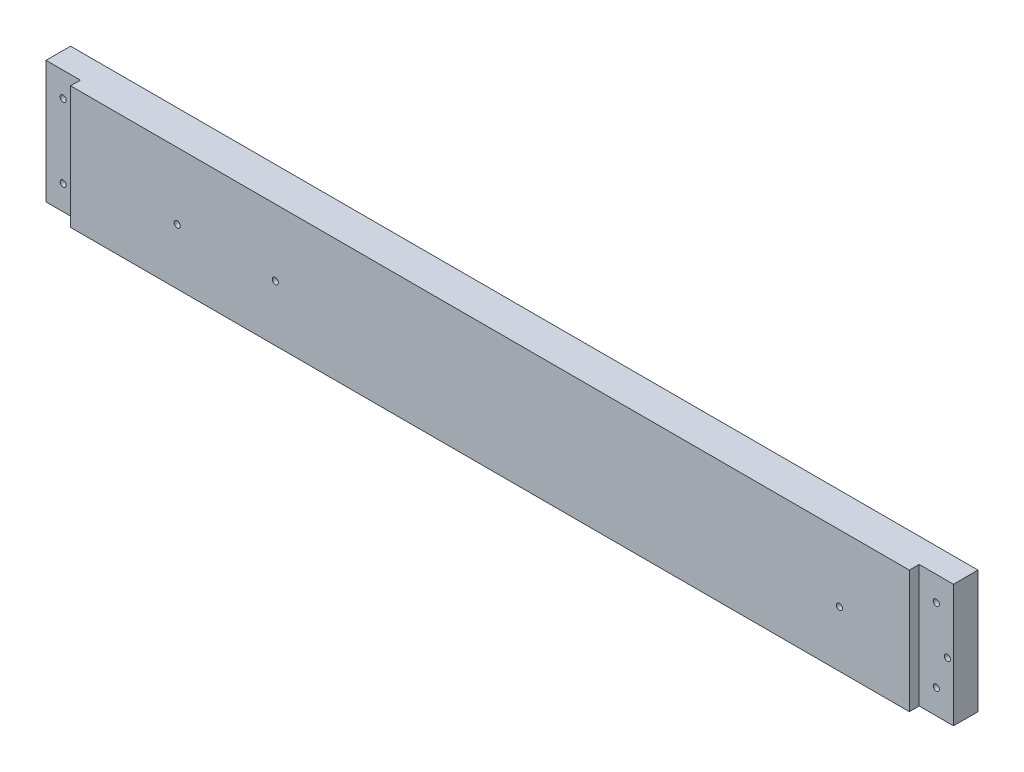
ISO-10303-21;
HEADER;
FILE_DESCRIPTION(('STEP AP214'),'2;1');
FILE_NAME('part.step','',(''),(''),'','','');
FILE_SCHEMA(('AUTOMOTIVE_DESIGN { 1 0 10303 214 1 1 1 1 }'));
ENDSEC;
DATA;
#1=APPLICATION_CONTEXT('core data for automotive mechanical design processes');
#2=APPLICATION_PROTOCOL_DEFINITION('international standard','automotive_design',2000,#1);
#3=PRODUCT_CONTEXT('',#1,'mechanical');
#4=PRODUCT('Part','Part','',(#3));
#5=PRODUCT_RELATED_PRODUCT_CATEGORY('part','',(#4));
#6=PRODUCT_DEFINITION_FORMATION('','',#4);
#7=PRODUCT_DEFINITION_CONTEXT('part definition',#1,'design');
#8=PRODUCT_DEFINITION('design','',#6,#7);
#9=PRODUCT_DEFINITION_SHAPE('','',#8);
#10=(LENGTH_UNIT() NAMED_UNIT(*) SI_UNIT(.MILLI.,.METRE.));
#11=(NAMED_UNIT(*) PLANE_ANGLE_UNIT() SI_UNIT($,.RADIAN.));
#12=(NAMED_UNIT(*) SI_UNIT($,.STERADIAN.) SOLID_ANGLE_UNIT());
#13=UNCERTAINTY_MEASURE_WITH_UNIT(LENGTH_MEASURE(1.E-05),#10,'distance_accuracy_value','');
#14=(GEOMETRIC_REPRESENTATION_CONTEXT(3) GLOBAL_UNCERTAINTY_ASSIGNED_CONTEXT((#13)) GLOBAL_UNIT_ASSIGNED_CONTEXT((#10,
#11,#12)) REPRESENTATION_CONTEXT('',''));
#15=CARTESIAN_POINT('',(0.,0.,0.));
#16=DIRECTION('',(0.,0.,1.));
#17=DIRECTION('',(1.,0.,0.));
#18=AXIS2_PLACEMENT_3D('',#15,#16,#17);
#19=CARTESIAN_POINT('',(10838.3916666658,-5719.7625,-17.78));
#20=DIRECTION('',(0.,-1.,0.));
#21=DIRECTION('',(0.,0.,-1.));
#22=AXIS2_PLACEMENT_3D('',#19,#20,#21);
#23=PLANE('',#22);
#24=DIRECTION('',(0.,0.,1.));
#25=VECTOR('',#24,1.);
#26=CARTESIAN_POINT('',(10856.1716666658,-5719.7625,-5.08));
#27=LINE('',#26,#25);
#28=CARTESIAN_POINT('',(10856.1716666658,-5719.7625,-5.08));
#29=VERTEX_POINT('',#28);
#30=CARTESIAN_POINT('',(10856.1716666658,-5719.7625,0.));
#31=VERTEX_POINT('',#30);
#32=EDGE_CURVE('E47',#29,#31,#27,.T.);
#33=ORIENTED_EDGE('',*,*,#32,.F.);
#34=DIRECTION('',(1.,0.,0.));
#35=VECTOR('',#34,1.);
#36=CARTESIAN_POINT('',(10856.1716666658,-5719.7625,-5.08));
#37=LINE('',#36,#35);
#38=CARTESIAN_POINT('',(10838.3916666658,-5719.7625,-5.08));
#39=VERTEX_POINT('',#38);
#40=EDGE_CURVE('E114',#39,#29,#37,.T.);
#41=ORIENTED_EDGE('',*,*,#40,.F.);
#42=DIRECTION('',(0.,0.,1.));
#43=VECTOR('',#42,1.);
#44=CARTESIAN_POINT('',(10838.3916666658,-5719.7625,-17.78));
#45=LINE('',#44,#43);
#46=CARTESIAN_POINT('',(10838.3916666658,-5719.7625,-17.78));
#47=VERTEX_POINT('',#46);
#48=EDGE_CURVE('E11',#47,#39,#45,.T.);
#49=ORIENTED_EDGE('',*,*,#48,.F.);
#50=DIRECTION('',(1.,0.,0.));
#51=VECTOR('',#50,1.);
#52=CARTESIAN_POINT('',(10838.3916666658,-5719.7625,-17.78));
#53=LINE('',#52,#51);
#54=CARTESIAN_POINT('',(11308.2916666658,-5719.7625,-17.78));
#55=VERTEX_POINT('',#54);
#56=EDGE_CURVE('E185',#47,#55,#53,.T.);
#57=ORIENTED_EDGE('',*,*,#56,.T.);
#58=DIRECTION('',(0.,0.,1.));
#59=VECTOR('',#58,1.);
#60=CARTESIAN_POINT('',(11308.2916666658,-5719.7625,-17.78));
#61=LINE('',#60,#59);
#62=CARTESIAN_POINT('',(11308.2916666658,-5719.7625,-5.08));
#63=VERTEX_POINT('',#62);
#64=EDGE_CURVE('E123',#55,#63,#61,.T.);
#65=ORIENTED_EDGE('',*,*,#64,.T.);
#66=DIRECTION('',(1.,0.,0.));
#67=VECTOR('',#66,1.);
#68=CARTESIAN_POINT('',(11308.2916666658,-5719.7625,-5.08));
#69=LINE('',#68,#67);
#70=CARTESIAN_POINT('',(11290.5116666658,-5719.7625,-5.08));
#71=VERTEX_POINT('',#70);
#72=EDGE_CURVE('E172',#71,#63,#69,.T.);
#73=ORIENTED_EDGE('',*,*,#72,.F.);
#74=DIRECTION('',(0.,0.,1.));
#75=VECTOR('',#74,1.);
#76=CARTESIAN_POINT('',(11290.5116666658,-5719.7625,-5.08));
#77=LINE('',#76,#75);
#78=CARTESIAN_POINT('',(11290.5116666658,-5719.7625,0.));
#79=VERTEX_POINT('',#78);
#80=EDGE_CURVE('E179',#71,#79,#77,.T.);
#81=ORIENTED_EDGE('',*,*,#80,.T.);
#82=DIRECTION('',(1.,0.,0.));
#83=VECTOR('',#82,1.);
#84=CARTESIAN_POINT('',(10838.3916666658,-5719.7625,0.));
#85=LINE('',#84,#83);
#86=EDGE_CURVE('E182',#31,#79,#85,.T.);
#87=ORIENTED_EDGE('',*,*,#86,.F.);
#88=EDGE_LOOP('',(#33,#41,#49,#57,#65,#73,#81,#87));
#89=FACE_BOUND('',#88,.T.);
#90=ADVANCED_FACE('F31',(#89),#23,.T.);
#91=CARTESIAN_POINT('',(10838.3916666658,-5656.2625,-17.78));
#92=DIRECTION('',(-1.,0.,0.));
#93=DIRECTION('',(0.,0.,1.));
#94=AXIS2_PLACEMENT_3D('',#91,#92,#93);
#95=PLANE('',#94);
#96=DIRECTION('',(0.,-1.,0.));
#97=VECTOR('',#96,1.);
#98=CARTESIAN_POINT('',(10838.3916666658,-5719.7625,-5.08));
#99=LINE('',#98,#97);
#100=CARTESIAN_POINT('',(10838.3916666658,-5656.2625,-5.08));
#101=VERTEX_POINT('',#100);
#102=EDGE_CURVE('E102',#101,#39,#99,.T.);
#103=ORIENTED_EDGE('',*,*,#102,.F.);
#104=DIRECTION('',(0.,0.,1.));
#105=VECTOR('',#104,1.);
#106=CARTESIAN_POINT('',(10838.3916666658,-5656.2625,-17.78));
#107=LINE('',#106,#105);
#108=CARTESIAN_POINT('',(10838.3916666658,-5656.2625,-17.78));
#109=VERTEX_POINT('',#108);
#110=EDGE_CURVE('E39',#109,#101,#107,.T.);
#111=ORIENTED_EDGE('',*,*,#110,.F.);
#112=DIRECTION('',(0.,-1.,0.));
#113=VECTOR('',#112,1.);
#114=CARTESIAN_POINT('',(10838.3916666658,-5656.2625,-17.78));
#115=LINE('',#114,#113);
#116=EDGE_CURVE('E129',#109,#47,#115,.T.);
#117=ORIENTED_EDGE('',*,*,#116,.T.);
#118=ORIENTED_EDGE('',*,*,#48,.T.);
#119=EDGE_LOOP('',(#103,#111,#117,#118));
#120=FACE_BOUND('',#119,.T.);
#121=ADVANCED_FACE('F111',(#120),#95,.T.);
#122=CARTESIAN_POINT('',(11308.2916666658,-5656.2625,-17.78));
#123=DIRECTION('',(0.,1.,0.));
#124=DIRECTION('',(0.,0.,1.));
#125=AXIS2_PLACEMENT_3D('',#122,#123,#124);
#126=PLANE('',#125);
#127=DIRECTION('',(0.,0.,1.));
#128=VECTOR('',#127,1.);
#129=CARTESIAN_POINT('',(10856.1716666658,-5656.2625,-5.08));
#130=LINE('',#129,#128);
#131=CARTESIAN_POINT('',(10856.1716666658,-5656.2625,-5.08));
#132=VERTEX_POINT('',#131);
#133=CARTESIAN_POINT('',(10856.1716666658,-5656.2625,0.));
#134=VERTEX_POINT('',#133);
#135=EDGE_CURVE('E165',#132,#134,#130,.T.);
#136=ORIENTED_EDGE('',*,*,#135,.T.);
#137=DIRECTION('',(-1.,0.,0.));
#138=VECTOR('',#137,1.);
#139=CARTESIAN_POINT('',(11308.2916666658,-5656.2625,0.));
#140=LINE('',#139,#138);
#141=CARTESIAN_POINT('',(11290.5116666658,-5656.2625,0.));
#142=VERTEX_POINT('',#141);
#143=EDGE_CURVE('E189',#142,#134,#140,.T.);
#144=ORIENTED_EDGE('',*,*,#143,.F.);
#145=DIRECTION('',(0.,0.,1.));
#146=VECTOR('',#145,1.);
#147=CARTESIAN_POINT('',(11290.5116666658,-5656.2625,-5.08));
#148=LINE('',#147,#146);
#149=CARTESIAN_POINT('',(11290.5116666658,-5656.2625,-5.08));
#150=VERTEX_POINT('',#149);
#151=EDGE_CURVE('E55',#150,#142,#148,.T.);
#152=ORIENTED_EDGE('',*,*,#151,.F.);
#153=DIRECTION('',(-1.,0.,0.));
#154=VECTOR('',#153,1.);
#155=CARTESIAN_POINT('',(11290.5116666658,-5656.2625,-5.08));
#156=LINE('',#155,#154);
#157=CARTESIAN_POINT('',(11308.2916666658,-5656.2625,-5.08));
#158=VERTEX_POINT('',#157);
#159=EDGE_CURVE('E176',#158,#150,#156,.T.);
#160=ORIENTED_EDGE('',*,*,#159,.F.);
#161=DIRECTION('',(0.,0.,1.));
#162=VECTOR('',#161,1.);
#163=CARTESIAN_POINT('',(11308.2916666658,-5656.2625,-17.78));
#164=LINE('',#163,#162);
#165=CARTESIAN_POINT('',(11308.2916666658,-5656.2625,-17.78));
#166=VERTEX_POINT('',#165);
#167=EDGE_CURVE('E120',#166,#158,#164,.T.);
#168=ORIENTED_EDGE('',*,*,#167,.F.);
#169=DIRECTION('',(-1.,0.,0.));
#170=VECTOR('',#169,1.);
#171=CARTESIAN_POINT('',(11308.2916666658,-5656.2625,-17.78));
#172=LINE('',#171,#170);
#173=EDGE_CURVE('E118',#166,#109,#172,.T.);
#174=ORIENTED_EDGE('',*,*,#173,.T.);
#175=ORIENTED_EDGE('',*,*,#110,.T.);
#176=DIRECTION('',(-1.,0.,0.));
#177=VECTOR('',#176,1.);
#178=CARTESIAN_POINT('',(10838.3916666658,-5656.2625,-5.08));
#179=LINE('',#178,#177);
#180=EDGE_CURVE('E99',#132,#101,#179,.T.);
#181=ORIENTED_EDGE('',*,*,#180,.F.);
#182=EDGE_LOOP('',(#136,#144,#152,#160,#168,#174,#175,#181));
#183=FACE_BOUND('',#182,.T.);
#184=ADVANCED_FACE('F116',(#183),#126,.T.);
#185=CARTESIAN_POINT('',(11308.2916666658,-5719.7625,-17.78));
#186=DIRECTION('',(1.,0.,0.));
#187=DIRECTION('',(0.,0.,-1.));
#188=AXIS2_PLACEMENT_3D('',#185,#186,#187);
#189=PLANE('',#188);
#190=DIRECTION('',(0.,1.,0.));
#191=VECTOR('',#190,1.);
#192=CARTESIAN_POINT('',(11308.2916666658,-5656.2625,-5.08));
#193=LINE('',#192,#191);
#194=EDGE_CURVE('E174',#63,#158,#193,.T.);
#195=ORIENTED_EDGE('',*,*,#194,.F.);
#196=ORIENTED_EDGE('',*,*,#64,.F.);
#197=DIRECTION('',(0.,1.,0.));
#198=VECTOR('',#197,1.);
#199=CARTESIAN_POINT('',(11308.2916666658,-5719.7625,-17.78));
#200=LINE('',#199,#198);
#201=EDGE_CURVE('E188',#55,#166,#200,.T.);
#202=ORIENTED_EDGE('',*,*,#201,.T.);
#203=ORIENTED_EDGE('',*,*,#167,.T.);
#204=EDGE_LOOP('',(#195,#196,#202,#203));
#205=FACE_BOUND('',#204,.T.);
#206=ADVANCED_FACE('F210',(#205),#189,.T.);
#207=CARTESIAN_POINT('',(11308.2916666658,-5719.7625,-17.78));
#208=DIRECTION('',(0.,0.,1.));
#209=DIRECTION('',(1.,0.,0.));
#210=AXIS2_PLACEMENT_3D('',#207,#208,#209);
#211=PLANE('',#210);
#212=CARTESIAN_POINT('',(11305.1166666646,-5690.78745,-17.78));
#213=DIRECTION('',(0.,0.,-1.));
#214=DIRECTION('',(-1.,0.,0.));
#215=AXIS2_PLACEMENT_3D('',#212,#213,#214);
#216=CIRCLE('',#215,1.58749999999868);
#217=CARTESIAN_POINT('',(11303.5291666646,-5690.78745,-17.78));
#218=VERTEX_POINT('',#217);
#219=EDGE_CURVE('E368',#218,#218,#216,.T.);
#220=ORIENTED_EDGE('',*,*,#219,.F.);
#221=EDGE_LOOP('',(#220));
#222=FACE_BOUND('',#221,.T.);
#223=CARTESIAN_POINT('',(11254.3166666646,-5690.78745,-17.78));
#224=DIRECTION('',(0.,0.,-1.));
#225=DIRECTION('',(-1.,0.,0.));
#226=AXIS2_PLACEMENT_3D('',#223,#224,#225);
#227=CIRCLE('',#226,1.58749999999868);
#228=CARTESIAN_POINT('',(11252.7291666646,-5690.78745,-17.78));
#229=VERTEX_POINT('',#228);
#230=EDGE_CURVE('E371',#229,#229,#227,.T.);
#231=ORIENTED_EDGE('',*,*,#230,.F.);
#232=EDGE_LOOP('',(#231));
#233=FACE_BOUND('',#232,.T.);
#234=CARTESIAN_POINT('',(10962.2166666646,-5690.78745,-17.78));
#235=DIRECTION('',(0.,0.,-1.));
#236=DIRECTION('',(-1.,0.,0.));
#237=AXIS2_PLACEMENT_3D('',#234,#235,#236);
#238=CIRCLE('',#237,1.58749999999868);
#239=CARTESIAN_POINT('',(10960.6291666646,-5690.78745,-17.78));
#240=VERTEX_POINT('',#239);
#241=EDGE_CURVE('E379',#240,#240,#238,.T.);
#242=ORIENTED_EDGE('',*,*,#241,.F.);
#243=EDGE_LOOP('',(#242));
#244=FACE_BOUND('',#243,.T.);
#245=CARTESIAN_POINT('',(10911.4166666646,-5690.78745,-17.78));
#246=DIRECTION('',(0.,0.,-1.));
#247=DIRECTION('',(-1.,0.,0.));
#248=AXIS2_PLACEMENT_3D('',#245,#246,#247);
#249=CIRCLE('',#248,1.58749999999868);
#250=CARTESIAN_POINT('',(10909.8291666646,-5690.78745,-17.78));
#251=VERTEX_POINT('',#250);
#252=EDGE_CURVE('E154',#251,#251,#249,.T.);
#253=ORIENTED_EDGE('',*,*,#252,.F.);
#254=EDGE_LOOP('',(#253));
#255=FACE_BOUND('',#254,.T.);
#256=CARTESIAN_POINT('',(11299.4016666658,-5668.9625,-17.78));
#257=DIRECTION('',(0.,0.,1.));
#258=DIRECTION('',(1.,0.,0.));
#259=AXIS2_PLACEMENT_3D('',#256,#257,#258);
#260=CIRCLE('',#259,1.58750000000038);
#261=CARTESIAN_POINT('',(11300.9891666658,-5668.9625,-17.78));
#262=VERTEX_POINT('',#261);
#263=EDGE_CURVE('E143',#262,#262,#260,.F.);
#264=ORIENTED_EDGE('',*,*,#263,.F.);
#265=EDGE_LOOP('',(#264));
#266=FACE_BOUND('',#265,.T.);
#267=CARTESIAN_POINT('',(11299.4016666658,-5707.0625,-17.78));
#268=DIRECTION('',(0.,0.,1.));
#269=DIRECTION('',(1.,0.,0.));
#270=AXIS2_PLACEMENT_3D('',#267,#268,#269);
#271=CIRCLE('',#270,1.58750000000038);
#272=CARTESIAN_POINT('',(11300.9891666658,-5707.0625,-17.78));
#273=VERTEX_POINT('',#272);
#274=EDGE_CURVE('E140',#273,#273,#271,.F.);
#275=ORIENTED_EDGE('',*,*,#274,.F.);
#276=EDGE_LOOP('',(#275));
#277=FACE_BOUND('',#276,.T.);
#278=CARTESIAN_POINT('',(10847.2816666658,-5707.0625,-17.78));
#279=DIRECTION('',(0.,0.,1.));
#280=DIRECTION('',(1.,0.,0.));
#281=AXIS2_PLACEMENT_3D('',#278,#279,#280);
#282=CIRCLE('',#281,1.58749999999868);
#283=CARTESIAN_POINT('',(10848.8691666658,-5707.0625,-17.78));
#284=VERTEX_POINT('',#283);
#285=EDGE_CURVE('E137',#284,#284,#282,.F.);
#286=ORIENTED_EDGE('',*,*,#285,.F.);
#287=EDGE_LOOP('',(#286));
#288=FACE_BOUND('',#287,.T.);
#289=CARTESIAN_POINT('',(10847.2816666658,-5668.9625,-17.78));
#290=DIRECTION('',(0.,0.,1.));
#291=DIRECTION('',(1.,0.,0.));
#292=AXIS2_PLACEMENT_3D('',#289,#290,#291);
#293=CIRCLE('',#292,1.58750000000038);
#294=CARTESIAN_POINT('',(10848.8691666658,-5668.9625,-17.78));
#295=VERTEX_POINT('',#294);
#296=EDGE_CURVE('E133',#295,#295,#293,.F.);
#297=ORIENTED_EDGE('',*,*,#296,.F.);
#298=EDGE_LOOP('',(#297));
#299=FACE_BOUND('',#298,.T.);
#300=ORIENTED_EDGE('',*,*,#56,.F.);
#301=ORIENTED_EDGE('',*,*,#116,.F.);
#302=ORIENTED_EDGE('',*,*,#173,.F.);
#303=ORIENTED_EDGE('',*,*,#201,.F.);
#304=EDGE_LOOP('',(#300,#301,#302,#303));
#305=FACE_BOUND('',#304,.T.);
#306=ADVANCED_FACE('F212',(#222,#233,#244,#255,#266,#277,#288,#299,#305),#211,.F.);
#307=CARTESIAN_POINT('',(11308.2916666658,-5719.7625,0.));
#308=DIRECTION('',(0.,0.,1.));
#309=DIRECTION('',(1.,0.,0.));
#310=AXIS2_PLACEMENT_3D('',#307,#308,#309);
#311=PLANE('',#310);
#312=CARTESIAN_POINT('',(11254.3166666646,-5690.78745,0.));
#313=DIRECTION('',(0.,0.,1.));
#314=DIRECTION('',(1.,0.,0.));
#315=AXIS2_PLACEMENT_3D('',#312,#313,#314);
#316=CIRCLE('',#315,1.58749999999868);
#317=CARTESIAN_POINT('',(11255.9041666646,-5690.78745,0.));
#318=VERTEX_POINT('',#317);
#319=EDGE_CURVE('E373',#318,#318,#316,.F.);
#320=ORIENTED_EDGE('',*,*,#319,.T.);
#321=EDGE_LOOP('',(#320));
#322=FACE_BOUND('',#321,.T.);
#323=CARTESIAN_POINT('',(10962.2166666646,-5690.78745,0.));
#324=DIRECTION('',(0.,0.,1.));
#325=DIRECTION('',(1.,0.,0.));
#326=AXIS2_PLACEMENT_3D('',#323,#324,#325);
#327=CIRCLE('',#326,1.58749999999868);
#328=CARTESIAN_POINT('',(10963.8041666646,-5690.78745,0.));
#329=VERTEX_POINT('',#328);
#330=EDGE_CURVE('E382',#329,#329,#327,.F.);
#331=ORIENTED_EDGE('',*,*,#330,.T.);
#332=EDGE_LOOP('',(#331));
#333=FACE_BOUND('',#332,.T.);
#334=CARTESIAN_POINT('',(10911.4166666646,-5690.78745,0.));
#335=DIRECTION('',(0.,0.,1.));
#336=DIRECTION('',(1.,0.,0.));
#337=AXIS2_PLACEMENT_3D('',#334,#335,#336);
#338=CIRCLE('',#337,1.58749999999868);
#339=CARTESIAN_POINT('',(10913.0041666646,-5690.78745,0.));
#340=VERTEX_POINT('',#339);
#341=EDGE_CURVE('E149',#340,#340,#338,.F.);
#342=ORIENTED_EDGE('',*,*,#341,.T.);
#343=EDGE_LOOP('',(#342));
#344=FACE_BOUND('',#343,.T.);
#345=DIRECTION('',(0.,1.,0.));
#346=VECTOR('',#345,1.);
#347=CARTESIAN_POINT('',(10856.1716666658,-5656.2625,0.));
#348=LINE('',#347,#346);
#349=EDGE_CURVE('E108',#31,#134,#348,.T.);
#350=ORIENTED_EDGE('',*,*,#349,.F.);
#351=ORIENTED_EDGE('',*,*,#86,.T.);
#352=DIRECTION('',(0.,-1.,0.));
#353=VECTOR('',#352,1.);
#354=CARTESIAN_POINT('',(11290.5116666658,-5719.7625,0.));
#355=LINE('',#354,#353);
#356=EDGE_CURVE('E167',#142,#79,#355,.T.);
#357=ORIENTED_EDGE('',*,*,#356,.F.);
#358=ORIENTED_EDGE('',*,*,#143,.T.);
#359=EDGE_LOOP('',(#350,#351,#357,#358));
#360=FACE_BOUND('',#359,.T.);
#361=ADVANCED_FACE('F197',(#322,#333,#344,#360),#311,.T.);
#362=CARTESIAN_POINT('',(11290.5116666658,-5719.7625,-5.08));
#363=DIRECTION('',(-1.,0.,0.));
#364=DIRECTION('',(0.,0.,1.));
#365=AXIS2_PLACEMENT_3D('',#362,#363,#364);
#366=PLANE('',#365);
#367=ORIENTED_EDGE('',*,*,#356,.T.);
#368=ORIENTED_EDGE('',*,*,#80,.F.);
#369=DIRECTION('',(0.,-1.,0.));
#370=VECTOR('',#369,1.);
#371=CARTESIAN_POINT('',(11290.5116666658,-5719.7625,-5.08));
#372=LINE('',#371,#370);
#373=EDGE_CURVE('E169',#150,#71,#372,.T.);
#374=ORIENTED_EDGE('',*,*,#373,.F.);
#375=ORIENTED_EDGE('',*,*,#151,.T.);
#376=EDGE_LOOP('',(#367,#368,#374,#375));
#377=FACE_BOUND('',#376,.T.);
#378=ADVANCED_FACE('F203',(#377),#366,.F.);
#379=CARTESIAN_POINT('',(11290.5116666658,-5656.2625,-5.08));
#380=DIRECTION('',(0.,0.,-1.));
#381=DIRECTION('',(-1.,0.,0.));
#382=AXIS2_PLACEMENT_3D('',#379,#380,#381);
#383=PLANE('',#382);
#384=CARTESIAN_POINT('',(11305.1166666646,-5690.78745,-5.08));
#385=DIRECTION('',(0.,0.,-1.));
#386=DIRECTION('',(-1.,0.,0.));
#387=AXIS2_PLACEMENT_3D('',#384,#385,#386);
#388=CIRCLE('',#387,1.58749999999868);
#389=CARTESIAN_POINT('',(11303.5291666646,-5690.78745,-5.08));
#390=VERTEX_POINT('',#389);
#391=EDGE_CURVE('E34',#390,#390,#388,.T.);
#392=ORIENTED_EDGE('',*,*,#391,.T.);
#393=EDGE_LOOP('',(#392));
#394=FACE_BOUND('',#393,.T.);
#395=CARTESIAN_POINT('',(11299.4016666658,-5668.9625,-5.08));
#396=DIRECTION('',(0.,0.,-1.));
#397=DIRECTION('',(-1.,0.,0.));
#398=AXIS2_PLACEMENT_3D('',#395,#396,#397);
#399=CIRCLE('',#398,1.58750000000038);
#400=CARTESIAN_POINT('',(11297.8141666658,-5668.9625,-5.08));
#401=VERTEX_POINT('',#400);
#402=EDGE_CURVE('E141',#401,#401,#399,.T.);
#403=ORIENTED_EDGE('',*,*,#402,.T.);
#404=EDGE_LOOP('',(#403));
#405=FACE_BOUND('',#404,.T.);
#406=CARTESIAN_POINT('',(11299.4016666658,-5707.0625,-5.08));
#407=DIRECTION('',(0.,0.,-1.));
#408=DIRECTION('',(-1.,0.,0.));
#409=AXIS2_PLACEMENT_3D('',#406,#407,#408);
#410=CIRCLE('',#409,1.58750000000038);
#411=CARTESIAN_POINT('',(11297.8141666658,-5707.0625,-5.08));
#412=VERTEX_POINT('',#411);
#413=EDGE_CURVE('E138',#412,#412,#410,.T.);
#414=ORIENTED_EDGE('',*,*,#413,.T.);
#415=EDGE_LOOP('',(#414));
#416=FACE_BOUND('',#415,.T.);
#417=ORIENTED_EDGE('',*,*,#373,.T.);
#418=ORIENTED_EDGE('',*,*,#72,.T.);
#419=ORIENTED_EDGE('',*,*,#194,.T.);
#420=ORIENTED_EDGE('',*,*,#159,.T.);
#421=EDGE_LOOP('',(#417,#418,#419,#420));
#422=FACE_BOUND('',#421,.T.);
#423=ADVANCED_FACE('F205',(#394,#405,#416,#422),#383,.F.);
#424=CARTESIAN_POINT('',(10856.1716666658,-5656.2625,-5.08));
#425=DIRECTION('',(1.,0.,0.));
#426=DIRECTION('',(0.,0.,-1.));
#427=AXIS2_PLACEMENT_3D('',#424,#425,#426);
#428=PLANE('',#427);
#429=ORIENTED_EDGE('',*,*,#349,.T.);
#430=ORIENTED_EDGE('',*,*,#135,.F.);
#431=DIRECTION('',(0.,1.,0.));
#432=VECTOR('',#431,1.);
#433=CARTESIAN_POINT('',(10856.1716666658,-5656.2625,-5.08));
#434=LINE('',#433,#432);
#435=EDGE_CURVE('E104',#29,#132,#434,.T.);
#436=ORIENTED_EDGE('',*,*,#435,.F.);
#437=ORIENTED_EDGE('',*,*,#32,.T.);
#438=EDGE_LOOP('',(#429,#430,#436,#437));
#439=FACE_BOUND('',#438,.T.);
#440=ADVANCED_FACE('F200',(#439),#428,.F.);
#441=CARTESIAN_POINT('',(10856.1716666658,-5656.2625,-5.08));
#442=DIRECTION('',(0.,0.,-1.));
#443=DIRECTION('',(-1.,0.,0.));
#444=AXIS2_PLACEMENT_3D('',#441,#442,#443);
#445=PLANE('',#444);
#446=CARTESIAN_POINT('',(10847.2816666658,-5707.0625,-5.08));
#447=DIRECTION('',(0.,0.,-1.));
#448=DIRECTION('',(-1.,0.,0.));
#449=AXIS2_PLACEMENT_3D('',#446,#447,#448);
#450=CIRCLE('',#449,1.58749999999868);
#451=CARTESIAN_POINT('',(10845.6941666658,-5707.0625,-5.08));
#452=VERTEX_POINT('',#451);
#453=EDGE_CURVE('E134',#452,#452,#450,.T.);
#454=ORIENTED_EDGE('',*,*,#453,.T.);
#455=EDGE_LOOP('',(#454));
#456=FACE_BOUND('',#455,.T.);
#457=CARTESIAN_POINT('',(10847.2816666658,-5668.9625,-5.08));
#458=DIRECTION('',(0.,0.,-1.));
#459=DIRECTION('',(-1.,0.,0.));
#460=AXIS2_PLACEMENT_3D('',#457,#458,#459);
#461=CIRCLE('',#460,1.58750000000038);
#462=CARTESIAN_POINT('',(10845.6941666658,-5668.9625,-5.08));
#463=VERTEX_POINT('',#462);
#464=EDGE_CURVE('E130',#463,#463,#461,.T.);
#465=ORIENTED_EDGE('',*,*,#464,.T.);
#466=EDGE_LOOP('',(#465));
#467=FACE_BOUND('',#466,.T.);
#468=ORIENTED_EDGE('',*,*,#180,.T.);
#469=ORIENTED_EDGE('',*,*,#102,.T.);
#470=ORIENTED_EDGE('',*,*,#40,.T.);
#471=ORIENTED_EDGE('',*,*,#435,.T.);
#472=EDGE_LOOP('',(#468,#469,#470,#471));
#473=FACE_BOUND('',#472,.T.);
#474=ADVANCED_FACE('F101',(#456,#467,#473),#445,.F.);
#475=CARTESIAN_POINT('',(10847.2816666658,-5668.9625,-22.2701280605367));
#476=DIRECTION('',(0.,0.,1.));
#477=DIRECTION('',(1.,0.,0.));
#478=AXIS2_PLACEMENT_3D('',#475,#476,#477);
#479=CYLINDRICAL_SURFACE('',#478,1.58750000000038);
#480=ORIENTED_EDGE('',*,*,#296,.T.);
#481=EDGE_LOOP('',(#480));
#482=FACE_BOUND('',#481,.T.);
#483=ORIENTED_EDGE('',*,*,#464,.F.);
#484=EDGE_LOOP('',(#483));
#485=FACE_BOUND('',#484,.T.);
#486=ADVANCED_FACE('F268',(#482,#485),#479,.F.);
#487=CARTESIAN_POINT('',(10847.2816666658,-5707.0625,-22.2701280605367));
#488=DIRECTION('',(0.,0.,1.));
#489=DIRECTION('',(1.,0.,0.));
#490=AXIS2_PLACEMENT_3D('',#487,#488,#489);
#491=CYLINDRICAL_SURFACE('',#490,1.58749999999868);
#492=ORIENTED_EDGE('',*,*,#285,.T.);
#493=EDGE_LOOP('',(#492));
#494=FACE_BOUND('',#493,.T.);
#495=ORIENTED_EDGE('',*,*,#453,.F.);
#496=EDGE_LOOP('',(#495));
#497=FACE_BOUND('',#496,.T.);
#498=ADVANCED_FACE('F278',(#494,#497),#491,.F.);
#499=CARTESIAN_POINT('',(11299.4016666658,-5707.0625,-22.2701280605367));
#500=DIRECTION('',(0.,0.,1.));
#501=DIRECTION('',(1.,0.,0.));
#502=AXIS2_PLACEMENT_3D('',#499,#500,#501);
#503=CYLINDRICAL_SURFACE('',#502,1.58750000000038);
#504=ORIENTED_EDGE('',*,*,#274,.T.);
#505=EDGE_LOOP('',(#504));
#506=FACE_BOUND('',#505,.T.);
#507=ORIENTED_EDGE('',*,*,#413,.F.);
#508=EDGE_LOOP('',(#507));
#509=FACE_BOUND('',#508,.T.);
#510=ADVANCED_FACE('F288',(#506,#509),#503,.F.);
#511=CARTESIAN_POINT('',(11299.4016666658,-5668.9625,-22.2701280605367));
#512=DIRECTION('',(0.,0.,1.));
#513=DIRECTION('',(1.,0.,0.));
#514=AXIS2_PLACEMENT_3D('',#511,#512,#513);
#515=CYLINDRICAL_SURFACE('',#514,1.58750000000038);
#516=ORIENTED_EDGE('',*,*,#263,.T.);
#517=EDGE_LOOP('',(#516));
#518=FACE_BOUND('',#517,.T.);
#519=ORIENTED_EDGE('',*,*,#402,.F.);
#520=EDGE_LOOP('',(#519));
#521=FACE_BOUND('',#520,.T.);
#522=ADVANCED_FACE('F298',(#518,#521),#515,.F.);
#523=CARTESIAN_POINT('',(10911.4166666646,-5690.78745,4.49012806053164));
#524=DIRECTION('',(0.,0.,-1.));
#525=DIRECTION('',(-1.,0.,0.));
#526=AXIS2_PLACEMENT_3D('',#523,#524,#525);
#527=CYLINDRICAL_SURFACE('',#526,1.58749999999868);
#528=ORIENTED_EDGE('',*,*,#252,.T.);
#529=EDGE_LOOP('',(#528));
#530=FACE_BOUND('',#529,.T.);
#531=ORIENTED_EDGE('',*,*,#341,.F.);
#532=EDGE_LOOP('',(#531));
#533=FACE_BOUND('',#532,.T.);
#534=ADVANCED_FACE('F307',(#530,#533),#527,.F.);
#535=CARTESIAN_POINT('',(10962.2166666646,-5690.78745,4.49012806053164));
#536=DIRECTION('',(0.,0.,-1.));
#537=DIRECTION('',(-1.,0.,0.));
#538=AXIS2_PLACEMENT_3D('',#535,#536,#537);
#539=CYLINDRICAL_SURFACE('',#538,1.58749999999868);
#540=ORIENTED_EDGE('',*,*,#241,.T.);
#541=EDGE_LOOP('',(#540));
#542=FACE_BOUND('',#541,.T.);
#543=ORIENTED_EDGE('',*,*,#330,.F.);
#544=EDGE_LOOP('',(#543));
#545=FACE_BOUND('',#544,.T.);
#546=ADVANCED_FACE('F332',(#542,#545),#539,.F.);
#547=CARTESIAN_POINT('',(11254.3166666646,-5690.78745,4.49012806053164));
#548=DIRECTION('',(0.,0.,-1.));
#549=DIRECTION('',(-1.,0.,0.));
#550=AXIS2_PLACEMENT_3D('',#547,#548,#549);
#551=CYLINDRICAL_SURFACE('',#550,1.58749999999868);
#552=ORIENTED_EDGE('',*,*,#230,.T.);
#553=EDGE_LOOP('',(#552));
#554=FACE_BOUND('',#553,.T.);
#555=ORIENTED_EDGE('',*,*,#319,.F.);
#556=EDGE_LOOP('',(#555));
#557=FACE_BOUND('',#556,.T.);
#558=ADVANCED_FACE('F342',(#554,#557),#551,.F.);
#559=CARTESIAN_POINT('',(11305.1166666646,-5690.78745,4.49012806053164));
#560=DIRECTION('',(0.,0.,-1.));
#561=DIRECTION('',(-1.,0.,0.));
#562=AXIS2_PLACEMENT_3D('',#559,#560,#561);
#563=CYLINDRICAL_SURFACE('',#562,1.58749999999868);
#564=ORIENTED_EDGE('',*,*,#219,.T.);
#565=EDGE_LOOP('',(#564));
#566=FACE_BOUND('',#565,.T.);
#567=ORIENTED_EDGE('',*,*,#391,.F.);
#568=EDGE_LOOP('',(#567));
#569=FACE_BOUND('',#568,.T.);
#570=ADVANCED_FACE('F352',(#566,#569),#563,.F.);
#571=CLOSED_SHELL('',(#90,#121,#184,#206,#306,#361,#378,#423,#440,#474,#486,#498,#510,#522,#534,
#546,#558,#570));
#572=MANIFOLD_SOLID_BREP('B2',#571);
#573=ADVANCED_BREP_SHAPE_REPRESENTATION('',(#18,#572),#14);
#574=SHAPE_DEFINITION_REPRESENTATION(#9,#573);
ENDSEC;
END-ISO-10303-21;
